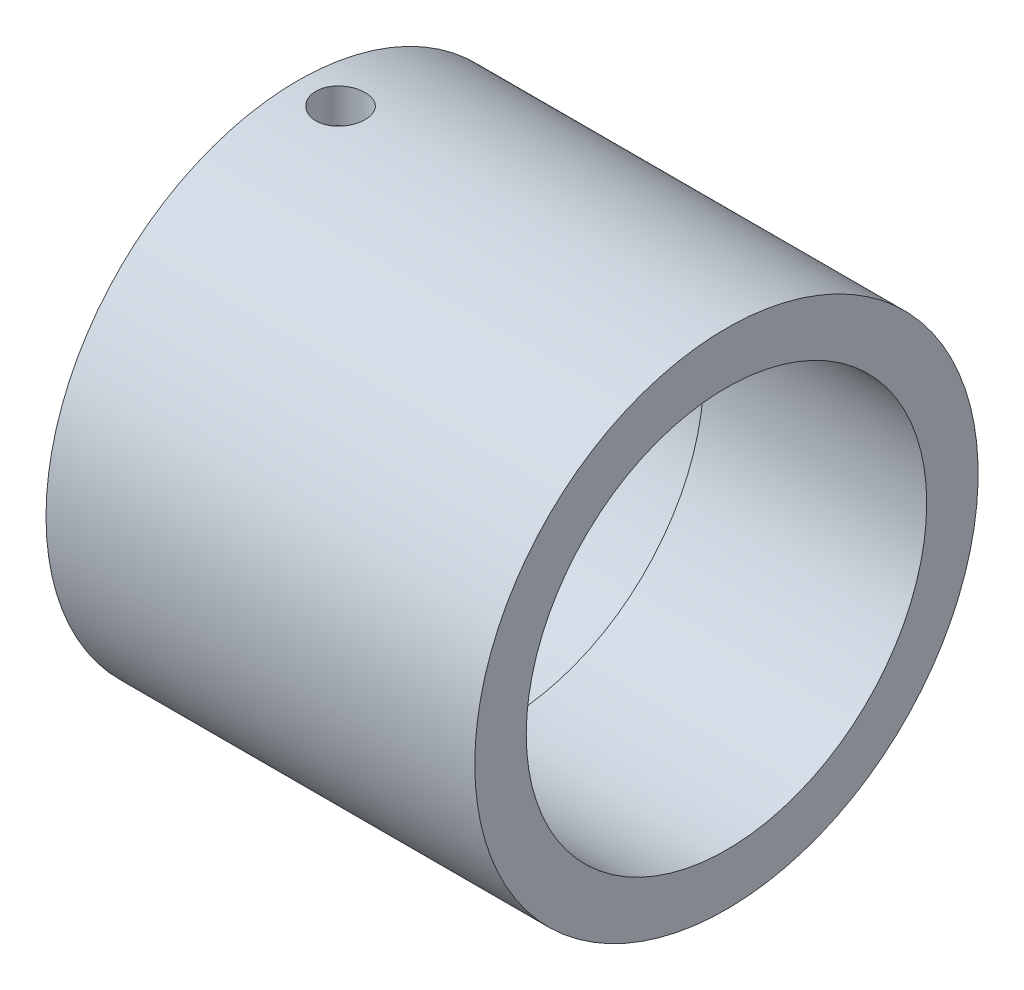
ISO-10303-21;
HEADER;
FILE_DESCRIPTION(('STEP AP214'),'2;1');
FILE_NAME('part.step','',(''),(''),'','','');
FILE_SCHEMA(('AUTOMOTIVE_DESIGN { 1 0 10303 214 1 1 1 1 }'));
ENDSEC;
DATA;
#1=APPLICATION_CONTEXT('core data for automotive mechanical design processes');
#2=APPLICATION_PROTOCOL_DEFINITION('international standard','automotive_design',2000,#1);
#3=PRODUCT_CONTEXT('',#1,'mechanical');
#4=PRODUCT('Part','Part','',(#3));
#5=PRODUCT_RELATED_PRODUCT_CATEGORY('part','',(#4));
#6=PRODUCT_DEFINITION_FORMATION('','',#4);
#7=PRODUCT_DEFINITION_CONTEXT('part definition',#1,'design');
#8=PRODUCT_DEFINITION('design','',#6,#7);
#9=PRODUCT_DEFINITION_SHAPE('','',#8);
#10=(LENGTH_UNIT() NAMED_UNIT(*) SI_UNIT(.MILLI.,.METRE.));
#11=(NAMED_UNIT(*) PLANE_ANGLE_UNIT() SI_UNIT($,.RADIAN.));
#12=(NAMED_UNIT(*) SI_UNIT($,.STERADIAN.) SOLID_ANGLE_UNIT());
#13=UNCERTAINTY_MEASURE_WITH_UNIT(LENGTH_MEASURE(1.E-05),#10,'distance_accuracy_value','');
#14=(GEOMETRIC_REPRESENTATION_CONTEXT(3) GLOBAL_UNCERTAINTY_ASSIGNED_CONTEXT((#13)) GLOBAL_UNIT_ASSIGNED_CONTEXT((#10,
#11,#12)) REPRESENTATION_CONTEXT('',''));
#15=CARTESIAN_POINT('',(0.,0.,0.));
#16=DIRECTION('',(0.,0.,1.));
#17=DIRECTION('',(1.,0.,0.));
#18=AXIS2_PLACEMENT_3D('',#15,#16,#17);
#19=CARTESIAN_POINT('',(0.,0.,-14.675));
#20=DIRECTION('',(-1.,0.,0.));
#21=DIRECTION('',(0.,0.,1.));
#22=AXIS2_PLACEMENT_3D('',#19,#20,#21);
#23=PLANE('',#22);
#24=CARTESIAN_POINT('',(0.,0.,0.));
#25=DIRECTION('',(-1.,0.,0.));
#26=DIRECTION('',(0.,0.,1.));
#27=AXIS2_PLACEMENT_3D('',#24,#25,#26);
#28=CIRCLE('',#27,14.675);
#29=CARTESIAN_POINT('',(0.,0.,14.675));
#30=VERTEX_POINT('',#29);
#31=EDGE_CURVE('E106',#30,#30,#28,.T.);
#32=ORIENTED_EDGE('',*,*,#31,.F.);
#33=EDGE_LOOP('',(#32));
#34=FACE_BOUND('',#33,.T.);
#35=CARTESIAN_POINT('',(0.,0.,0.));
#36=DIRECTION('',(-1.,0.,0.));
#37=DIRECTION('',(0.,0.,1.));
#38=AXIS2_PLACEMENT_3D('',#35,#36,#37);
#39=CIRCLE('',#38,11.675);
#40=CARTESIAN_POINT('',(0.,0.,11.675));
#41=VERTEX_POINT('',#40);
#42=EDGE_CURVE('E45',#41,#41,#39,.T.);
#43=ORIENTED_EDGE('',*,*,#42,.T.);
#44=EDGE_LOOP('',(#43));
#45=FACE_BOUND('',#44,.T.);
#46=ADVANCED_FACE('F31',(#34,#45),#23,.F.);
#47=CARTESIAN_POINT('',(-30.3673803315951,0.,0.));
#48=DIRECTION('',(-1.,0.,0.));
#49=DIRECTION('',(0.,0.,1.));
#50=AXIS2_PLACEMENT_3D('',#47,#48,#49);
#51=CYLINDRICAL_SURFACE('',#50,11.675);
#52=ORIENTED_EDGE('',*,*,#42,.F.);
#53=EDGE_LOOP('',(#52));
#54=FACE_BOUND('',#53,.T.);
#55=CARTESIAN_POINT('',(-13.,0.,0.));
#56=DIRECTION('',(-1.,0.,0.));
#57=DIRECTION('',(0.,0.,1.));
#58=AXIS2_PLACEMENT_3D('',#55,#56,#57);
#59=CIRCLE('',#58,11.675);
#60=CARTESIAN_POINT('',(-13.,0.,11.675));
#61=VERTEX_POINT('',#60);
#62=EDGE_CURVE('E49',#61,#61,#59,.T.);
#63=ORIENTED_EDGE('',*,*,#62,.T.);
#64=EDGE_LOOP('',(#63));
#65=FACE_BOUND('',#64,.T.);
#66=ADVANCED_FACE('F85',(#54,#65),#51,.F.);
#67=CARTESIAN_POINT('',(-13.,0.,-11.675));
#68=DIRECTION('',(1.,0.,0.));
#69=DIRECTION('',(0.,0.,-1.));
#70=AXIS2_PLACEMENT_3D('',#67,#68,#69);
#71=PLANE('',#70);
#72=ORIENTED_EDGE('',*,*,#62,.F.);
#73=EDGE_LOOP('',(#72));
#74=FACE_BOUND('',#73,.T.);
#75=CARTESIAN_POINT('',(-13.,0.,0.));
#76=DIRECTION('',(-1.,0.,0.));
#77=DIRECTION('',(0.,0.,1.));
#78=AXIS2_PLACEMENT_3D('',#75,#76,#77);
#79=CIRCLE('',#78,12.675);
#80=CARTESIAN_POINT('',(-13.,0.,12.675));
#81=VERTEX_POINT('',#80);
#82=EDGE_CURVE('E97',#81,#81,#79,.T.);
#83=ORIENTED_EDGE('',*,*,#82,.T.);
#84=EDGE_LOOP('',(#83));
#85=FACE_BOUND('',#84,.T.);
#86=ADVANCED_FACE('F81',(#74,#85),#71,.F.);
#87=CARTESIAN_POINT('',(-30.3673803315951,0.,0.));
#88=DIRECTION('',(-1.,0.,0.));
#89=DIRECTION('',(0.,0.,1.));
#90=AXIS2_PLACEMENT_3D('',#87,#88,#89);
#91=CYLINDRICAL_SURFACE('',#90,12.675);
#92=CARTESIAN_POINT('',(-22.5,-12.5935062631501,1.435));
#93=CARTESIAN_POINT('',(-22.5803269633296,-12.5935073193798,1.43499655106017));
#94=CARTESIAN_POINT('',(-22.6607055840986,-12.5942830953082,1.42823257152357));
#95=CARTESIAN_POINT('',(-22.8192300836796,-12.5973015764013,1.40135428461897));
#96=CARTESIAN_POINT('',(-22.8973734717594,-12.5995458561851,1.3812256465106));
#97=CARTESIAN_POINT('',(-23.0491091300628,-12.6052439528025,1.32821538258512));
#98=CARTESIAN_POINT('',(-23.1227042893579,-12.608696992335,1.29534195093697));
#99=CARTESIAN_POINT('',(-23.2633180971489,-12.6164225923108,1.21779193801993));
#100=CARTESIAN_POINT('',(-23.3303379572645,-12.62069500134,1.17311753691955));
#101=CARTESIAN_POINT('',(-23.4562230108082,-12.6296000458246,1.0730124711608));
#102=CARTESIAN_POINT('',(-23.5150534951842,-12.6342340919284,1.01753827979628));
#103=CARTESIAN_POINT('',(-23.6225904423951,-12.6433275311458,0.897501771002371));
#104=CARTESIAN_POINT('',(-23.6712964220668,-12.6477869159159,0.832939020093825));
#105=CARTESIAN_POINT('',(-23.7573242838442,-12.6560428037771,0.696342350992764));
#106=CARTESIAN_POINT('',(-23.7946150592816,-12.6598374837213,0.624288722420786));
#107=CARTESIAN_POINT('',(-23.8565548518733,-12.6663209675617,0.474891927981048));
#108=CARTESIAN_POINT('',(-23.8812042576668,-12.6690098054548,0.397548924809797));
#109=CARTESIAN_POINT('',(-23.9170587412048,-12.6729687248718,0.240122080145635));
#110=CARTESIAN_POINT('',(-23.9283212356007,-12.6742448638505,0.160051470240858));
#111=CARTESIAN_POINT('',(-23.9372599966771,-12.6752552455972,-0.000852848252713375));
#112=CARTESIAN_POINT('',(-23.9349367070755,-12.6749895387227,-0.0816865318330791));
#113=CARTESIAN_POINT('',(-23.9168161583721,-12.6729510952702,-0.241432218458438));
#114=CARTESIAN_POINT('',(-23.90108064364,-12.671185264768,-0.320351325874863));
#115=CARTESIAN_POINT('',(-23.8566786732493,-12.6663528250065,-0.474421314646284));
#116=CARTESIAN_POINT('',(-23.8280120098467,-12.6632861948495,-0.54957213544071));
#117=CARTESIAN_POINT('',(-23.7584948083044,-12.6561849200862,-0.6941651810532));
#118=CARTESIAN_POINT('',(-23.7176172499206,-12.6521481326309,-0.763594305614284));
#119=CARTESIAN_POINT('',(-23.6248582578162,-12.6435588451838,-0.894630195378186));
#120=CARTESIAN_POINT('',(-23.5729764100097,-12.6390063257883,-0.956236666078934));
#121=CARTESIAN_POINT('',(-23.4593350330123,-12.6298656274134,-1.07024067103761));
#122=CARTESIAN_POINT('',(-23.3975217409347,-12.625277391631,-1.12258462352737));
#123=CARTESIAN_POINT('',(-23.2659576654872,-12.6166077150984,-1.21616210590077));
#124=CARTESIAN_POINT('',(-23.1962068646,-12.6125262754667,-1.25739561126411));
#125=CARTESIAN_POINT('',(-23.0507032770789,-12.6053321765324,-1.32758313119968));
#126=CARTESIAN_POINT('',(-22.9749486410318,-12.6022198172105,-1.35653334445854));
#127=CARTESIAN_POINT('',(-22.8196103558718,-12.5973223216915,-1.40128753451199));
#128=CARTESIAN_POINT('',(-22.7400268573283,-12.595537133349,-1.41709202781338));
#129=CARTESIAN_POINT('',(-22.5797617418361,-12.5935054156559,-1.43503620395096));
#130=CARTESIAN_POINT('',(-22.4990886459588,-12.5932504207989,-1.4372510703644));
#131=CARTESIAN_POINT('',(-22.3385205180107,-12.5942855999477,-1.42815103342133));
#132=CARTESIAN_POINT('',(-22.2586254724227,-12.595575747061,-1.41683636554013));
#133=CARTESIAN_POINT('',(-22.1021036008946,-12.5995481322832,-1.38106154685739));
#134=CARTESIAN_POINT('',(-22.0254684467477,-12.6022265596683,-1.35663737415921));
#135=CARTESIAN_POINT('',(-21.877382042179,-12.6086706289983,-1.29537374014247));
#136=CARTESIAN_POINT('',(-21.8059309426628,-12.6124363025765,-1.25853391758589));
#137=CARTESIAN_POINT('',(-21.6698994598502,-12.6206509602795,-1.17329814067732));
#138=CARTESIAN_POINT('',(-21.6053503094742,-12.625102844965,-1.12485262434416));
#139=CARTESIAN_POINT('',(-21.4852727406331,-12.6341790201357,-1.01785119635597));
#140=CARTESIAN_POINT('',(-21.4297446091847,-12.6388033161006,-0.959294963136382));
#141=CARTESIAN_POINT('',(-21.3290236218181,-12.6477290622367,-0.83340699024054));
#142=CARTESIAN_POINT('',(-21.2838799921328,-12.6520289123139,-0.7660357359682));
#143=CARTESIAN_POINT('',(-21.2055491449992,-12.6597976922568,-0.624623799119411));
#144=CARTESIAN_POINT('',(-21.1723617243316,-12.6632666362451,-0.550583229927911));
#145=CARTESIAN_POINT('',(-21.1189677145968,-12.6689755903311,-0.39810208443873));
#146=CARTESIAN_POINT('',(-21.0987320388411,-12.6712183524912,-0.31967180063139));
#147=CARTESIAN_POINT('',(-21.0717211529702,-12.6742336091581,-0.160499898147202));
#148=CARTESIAN_POINT('',(-21.0649454502233,-12.6750061574745,-0.0797583641712842));
#149=CARTESIAN_POINT('',(-21.0650549088229,-12.6749938017734,0.0812620248818677));
#150=CARTESIAN_POINT('',(-21.0718639127472,-12.6742175803346,0.161540943155258));
#151=CARTESIAN_POINT('',(-21.0987890012936,-12.67121208525,0.319806194755735));
#152=CARTESIAN_POINT('',(-21.1189050873839,-12.6689828114439,0.397792527829874));
#153=CARTESIAN_POINT('',(-21.1718507706873,-12.6633207517606,0.549253500409719));
#154=CARTESIAN_POINT('',(-21.2046774143161,-12.6598882454993,0.622729183474558));
#155=CARTESIAN_POINT('',(-21.2821044532209,-12.6522010674011,0.76314044194555));
#156=CARTESIAN_POINT('',(-21.3267048853935,-12.6479463929877,0.83007599685546));
#157=CARTESIAN_POINT('',(-21.4266973882949,-12.6390621557962,0.955896803530534));
#158=CARTESIAN_POINT('',(-21.482146202323,-12.6344307000585,1.01473682833387));
#159=CARTESIAN_POINT('',(-21.602145719754,-12.6253305308848,1.12230845900698));
#160=CARTESIAN_POINT('',(-21.6666985887478,-12.6208618564888,1.17103765296777));
#161=CARTESIAN_POINT('',(-21.8033056058828,-12.6125780029848,1.25713304044774));
#162=CARTESIAN_POINT('',(-21.8753830259813,-12.6087649539785,1.29446249049536));
#163=CARTESIAN_POINT('',(-22.0247833433158,-12.6022491871702,1.35643660382062));
#164=CARTESIAN_POINT('',(-22.1021003215889,-12.5995452400337,1.38109531911425));
#165=CARTESIAN_POINT('',(-22.233197338107,-12.5962230901322,1.41100131416781));
#166=CARTESIAN_POINT('',(-22.2861445660978,-12.595209225077,1.41998820366492));
#167=CARTESIAN_POINT('',(-22.3927201837597,-12.5938504607883,1.43198868107949));
#168=CARTESIAN_POINT('',(-22.4463485694839,-12.5935055576804,1.43500230359207));
#169=CARTESIAN_POINT('',(-22.5,-12.5935062631501,1.435));
#170=B_SPLINE_CURVE_WITH_KNOTS('',3,(#92,#93,#94,#95,#96,#97,#98,#99,#100,#101,#102,#103,#104,
#105,#106,#107,#108,#109,#110,#111,#112,#113,#114,#115,#116,#117,#118,#119,#120,#121,#122,#123,
#124,#125,#126,#127,#128,#129,#130,#131,#132,#133,#134,#135,#136,#137,#138,#139,#140,#141,#142,
#143,#144,#145,#146,#147,#148,#149,#150,#151,#152,#153,#154,#155,#156,#157,#158,#159,#160,#161,
#162,#163,#164,#165,#166,#167,#168,#169),.UNSPECIFIED.,.T.,.F.,(4,2,2,2,2,2,2,2,2,2,2,2,2,2,2,2,
2,2,2,2,2,2,2,2,2,2,2,2,2,2,2,2,2,2,2,2,2,2,4),(0.,0.240784929522118,0.481828467301215,
0.722717284280372,0.96356162937428,1.20539753959266,1.44724498809349,1.68974572657963,
1.93223900930838,2.17368843822364,2.41512998133261,2.65546599312933,2.89580586615673,
3.13668155276468,3.37756630501335,3.61980195233018,3.86203813424649,4.10434922647075,
4.34665079763108,4.58761063611237,4.82856628085975,5.06886399614124,5.30916870357902,
5.55051852067947,5.79187601516286,6.03435507788281,6.27683001899669,6.51875848766894,
6.76067810165375,7.00124529738597,7.24181251966056,7.4823238742352,7.72283598252925,
7.96464146792292,8.20650456915651,8.44913920595521,8.69150417373401,8.85232851216289,
9.01315191914983),.UNSPECIFIED.);
#171=CARTESIAN_POINT('',(-22.5,-12.5935062631501,1.435));
#172=VERTEX_POINT('',#171);
#173=EDGE_CURVE('E72',#172,#172,#170,.T.);
#174=ORIENTED_EDGE('',*,*,#173,.T.);
#175=EDGE_LOOP('',(#174));
#176=FACE_BOUND('',#175,.T.);
#177=CARTESIAN_POINT('',(-22.5,12.5935062631501,1.435));
#178=CARTESIAN_POINT('',(-22.4196730366704,12.5935073193798,1.43499655106017));
#179=CARTESIAN_POINT('',(-22.3392944159014,12.5942830953082,1.42823257152357));
#180=CARTESIAN_POINT('',(-22.1807699163204,12.5973015764013,1.40135428461897));
#181=CARTESIAN_POINT('',(-22.1026265282406,12.5995458561851,1.3812256465106));
#182=CARTESIAN_POINT('',(-21.9508908699372,12.6052439528025,1.32821538258512));
#183=CARTESIAN_POINT('',(-21.8772957106421,12.608696992335,1.29534195093697));
#184=CARTESIAN_POINT('',(-21.7366819028511,12.6164225923108,1.21779193801993));
#185=CARTESIAN_POINT('',(-21.6696620427355,12.62069500134,1.17311753691955));
#186=CARTESIAN_POINT('',(-21.5437769891918,12.6296000458246,1.0730124711608));
#187=CARTESIAN_POINT('',(-21.4849465048158,12.6342340919284,1.01753827979628));
#188=CARTESIAN_POINT('',(-21.3774095576049,12.6433275311458,0.897501771002371));
#189=CARTESIAN_POINT('',(-21.3287035779332,12.6477869159159,0.832939020093825));
#190=CARTESIAN_POINT('',(-21.2426757161558,12.6560428037771,0.696342350992764));
#191=CARTESIAN_POINT('',(-21.2053849407183,12.6598374837213,0.624288722420786));
#192=CARTESIAN_POINT('',(-21.1434451481267,12.6663209675617,0.474891927981049));
#193=CARTESIAN_POINT('',(-21.1187957423332,12.6690098054548,0.397548924809799));
#194=CARTESIAN_POINT('',(-21.0829412587952,12.6729687248718,0.240122080145638));
#195=CARTESIAN_POINT('',(-21.0716787643993,12.6742448638505,0.16005147024086));
#196=CARTESIAN_POINT('',(-21.0627400033229,12.6752552455972,-0.000852848252711735));
#197=CARTESIAN_POINT('',(-21.0650632929245,12.6749895387227,-0.081686531833078));
#198=CARTESIAN_POINT('',(-21.0831838416279,12.6729510952702,-0.241432218458437));
#199=CARTESIAN_POINT('',(-21.09891935636,12.671185264768,-0.320351325874862));
#200=CARTESIAN_POINT('',(-21.1433213267507,12.6663528250065,-0.474421314646283));
#201=CARTESIAN_POINT('',(-21.1719879901533,12.6632861948495,-0.54957213544071));
#202=CARTESIAN_POINT('',(-21.2415051916956,12.6561849200862,-0.6941651810532));
#203=CARTESIAN_POINT('',(-21.2823827500794,12.6521481326309,-0.763594305614284));
#204=CARTESIAN_POINT('',(-21.3751417421838,12.6435588451838,-0.894630195378186));
#205=CARTESIAN_POINT('',(-21.4270235899903,12.6390063257883,-0.956236666078934));
#206=CARTESIAN_POINT('',(-21.5406649669877,12.6298656274134,-1.07024067103761));
#207=CARTESIAN_POINT('',(-21.6024782590653,12.625277391631,-1.12258462352737));
#208=CARTESIAN_POINT('',(-21.7340423345128,12.6166077150984,-1.21616210590077));
#209=CARTESIAN_POINT('',(-21.8037931354,12.6125262754667,-1.25739561126411));
#210=CARTESIAN_POINT('',(-21.9492967229211,12.6053321765324,-1.32758313119968));
#211=CARTESIAN_POINT('',(-22.0250513589682,12.6022198172105,-1.35653334445854));
#212=CARTESIAN_POINT('',(-22.1803896441282,12.5973223216915,-1.40128753451199));
#213=CARTESIAN_POINT('',(-22.2599731426717,12.595537133349,-1.41709202781338));
#214=CARTESIAN_POINT('',(-22.4202382581639,12.5935054156559,-1.43503620395096));
#215=CARTESIAN_POINT('',(-22.5009113540412,12.5932504207989,-1.4372510703644));
#216=CARTESIAN_POINT('',(-22.6614794819893,12.5942855999477,-1.42815103342133));
#217=CARTESIAN_POINT('',(-22.7413745275773,12.595575747061,-1.41683636554013));
#218=CARTESIAN_POINT('',(-22.8978963991054,12.5995481322832,-1.38106154685739));
#219=CARTESIAN_POINT('',(-22.9745315532523,12.6022265596683,-1.35663737415921));
#220=CARTESIAN_POINT('',(-23.122617957821,12.6086706289983,-1.29537374014247));
#221=CARTESIAN_POINT('',(-23.1940690573372,12.6124363025765,-1.25853391758589));
#222=CARTESIAN_POINT('',(-23.3301005401498,12.6206509602795,-1.17329814067732));
#223=CARTESIAN_POINT('',(-23.3946496905258,12.625102844965,-1.12485262434416));
#224=CARTESIAN_POINT('',(-23.5147272593669,12.6341790201357,-1.01785119635597));
#225=CARTESIAN_POINT('',(-23.5702553908153,12.6388033161006,-0.959294963136382));
#226=CARTESIAN_POINT('',(-23.6709763781819,12.6477290622367,-0.83340699024054));
#227=CARTESIAN_POINT('',(-23.7161200078672,12.6520289123139,-0.7660357359682));
#228=CARTESIAN_POINT('',(-23.7944508550008,12.6597976922568,-0.624623799119411));
#229=CARTESIAN_POINT('',(-23.8276382756684,12.6632666362451,-0.550583229927911));
#230=CARTESIAN_POINT('',(-23.8810322854032,12.6689755903311,-0.39810208443873));
#231=CARTESIAN_POINT('',(-23.9012679611589,12.6712183524912,-0.31967180063139));
#232=CARTESIAN_POINT('',(-23.9282788470298,12.6742336091581,-0.160499898147203));
#233=CARTESIAN_POINT('',(-23.9350545497767,12.6750061574745,-0.0797583641712844));
#234=CARTESIAN_POINT('',(-23.9349450911771,12.6749938017734,0.0812620248818675));
#235=CARTESIAN_POINT('',(-23.9281360872528,12.6742175803346,0.161540943155258));
#236=CARTESIAN_POINT('',(-23.9012109987064,12.67121208525,0.319806194755734));
#237=CARTESIAN_POINT('',(-23.8810949126161,12.6689828114439,0.397792527829874));
#238=CARTESIAN_POINT('',(-23.8281492293127,12.6633207517606,0.54925350040972));
#239=CARTESIAN_POINT('',(-23.7953225856839,12.6598882454993,0.622729183474559));
#240=CARTESIAN_POINT('',(-23.7178955467791,12.6522010674011,0.763140441945551));
#241=CARTESIAN_POINT('',(-23.6732951146065,12.6479463929877,0.83007599685546));
#242=CARTESIAN_POINT('',(-23.5733026117051,12.6390621557962,0.955896803530534));
#243=CARTESIAN_POINT('',(-23.517853797677,12.6344307000585,1.01473682833387));
#244=CARTESIAN_POINT('',(-23.397854280246,12.6253305308848,1.12230845900698));
#245=CARTESIAN_POINT('',(-23.3333014112521,12.6208618564888,1.17103765296777));
#246=CARTESIAN_POINT('',(-23.1966943941172,12.6125780029848,1.25713304044774));
#247=CARTESIAN_POINT('',(-23.1246169740187,12.6087649539785,1.29446249049536));
#248=CARTESIAN_POINT('',(-22.9752166566842,12.6022491871702,1.35643660382061));
#249=CARTESIAN_POINT('',(-22.8978996784111,12.5995452400337,1.38109531911425));
#250=CARTESIAN_POINT('',(-22.766802661893,12.5962230901322,1.41100131416781));
#251=CARTESIAN_POINT('',(-22.7138554339022,12.595209225077,1.41998820366492));
#252=CARTESIAN_POINT('',(-22.6072798162403,12.5938504607883,1.43198868107949));
#253=CARTESIAN_POINT('',(-22.5536514305161,12.5935055576804,1.43500230359207));
#254=CARTESIAN_POINT('',(-22.5,12.5935062631501,1.435));
#255=B_SPLINE_CURVE_WITH_KNOTS('',3,(#177,#178,#179,#180,#181,#182,#183,#184,#185,#186,#187,
#188,#189,#190,#191,#192,#193,#194,#195,#196,#197,#198,#199,#200,#201,#202,#203,#204,#205,#206,
#207,#208,#209,#210,#211,#212,#213,#214,#215,#216,#217,#218,#219,#220,#221,#222,#223,#224,#225,
#226,#227,#228,#229,#230,#231,#232,#233,#234,#235,#236,#237,#238,#239,#240,#241,#242,#243,#244,
#245,#246,#247,#248,#249,#250,#251,#252,#253,#254),.UNSPECIFIED.,.T.,.F.,(4,2,2,2,2,2,2,2,2,2,2,
2,2,2,2,2,2,2,2,2,2,2,2,2,2,2,2,2,2,2,2,2,2,2,2,2,2,2,4),(0.,0.240784929522118,
0.481828467301215,0.722717284280372,0.96356162937428,1.20539753959266,1.44724498809349,
1.68974572657963,1.93223900930838,2.17368843822363,2.41512998133261,2.65546599312933,
2.89580586615673,3.13668155276468,3.37756630501335,3.61980195233018,3.86203813424649,
4.10434922647075,4.34665079763108,4.58761063611237,4.82856628085975,5.06886399614124,
5.30916870357902,5.55051852067947,5.79187601516286,6.03435507788281,6.27683001899669,
6.51875848766894,6.76067810165375,7.00124529738597,7.24181251966055,7.4823238742352,
7.72283598252925,7.96464146792292,8.20650456915651,8.4491392059552,8.69150417373401,
8.8523285121629,9.01315191914983),.UNSPECIFIED.);
#256=CARTESIAN_POINT('',(-22.5,12.5935062631501,1.435));
#257=VERTEX_POINT('',#256);
#258=EDGE_CURVE('E67',#257,#257,#255,.T.);
#259=ORIENTED_EDGE('',*,*,#258,.T.);
#260=EDGE_LOOP('',(#259));
#261=FACE_BOUND('',#260,.T.);
#262=ORIENTED_EDGE('',*,*,#82,.F.);
#263=EDGE_LOOP('',(#262));
#264=FACE_BOUND('',#263,.T.);
#265=CARTESIAN_POINT('',(-25.,0.,0.));
#266=DIRECTION('',(-1.,0.,0.));
#267=DIRECTION('',(0.,0.,1.));
#268=AXIS2_PLACEMENT_3D('',#265,#266,#267);
#269=CIRCLE('',#268,12.675);
#270=CARTESIAN_POINT('',(-25.,0.,12.675));
#271=VERTEX_POINT('',#270);
#272=EDGE_CURVE('E99',#271,#271,#269,.T.);
#273=ORIENTED_EDGE('',*,*,#272,.T.);
#274=EDGE_LOOP('',(#273));
#275=FACE_BOUND('',#274,.T.);
#276=ADVANCED_FACE('F76',(#176,#261,#264,#275),#91,.F.);
#277=CARTESIAN_POINT('',(-25.,0.,-12.675));
#278=DIRECTION('',(1.,0.,0.));
#279=DIRECTION('',(0.,0.,-1.));
#280=AXIS2_PLACEMENT_3D('',#277,#278,#279);
#281=PLANE('',#280);
#282=ORIENTED_EDGE('',*,*,#272,.F.);
#283=EDGE_LOOP('',(#282));
#284=FACE_BOUND('',#283,.T.);
#285=CARTESIAN_POINT('',(-25.,0.,0.));
#286=DIRECTION('',(-1.,0.,0.));
#287=DIRECTION('',(0.,0.,1.));
#288=AXIS2_PLACEMENT_3D('',#285,#286,#287);
#289=CIRCLE('',#288,14.675);
#290=CARTESIAN_POINT('',(-25.,0.,14.675));
#291=VERTEX_POINT('',#290);
#292=EDGE_CURVE('E104',#291,#291,#289,.T.);
#293=ORIENTED_EDGE('',*,*,#292,.T.);
#294=EDGE_LOOP('',(#293));
#295=FACE_BOUND('',#294,.T.);
#296=ADVANCED_FACE('F80',(#284,#295),#281,.F.);
#297=CARTESIAN_POINT('',(-30.3673803315951,0.,0.));
#298=DIRECTION('',(-1.,0.,0.));
#299=DIRECTION('',(0.,0.,1.));
#300=AXIS2_PLACEMENT_3D('',#297,#298,#299);
#301=CYLINDRICAL_SURFACE('',#300,14.675);
#302=CARTESIAN_POINT('',(-23.935,-14.675,0.));
#303=CARTESIAN_POINT('',(-23.9349965138731,-14.6749990930978,0.0803986067015495));
#304=CARTESIAN_POINT('',(-23.9282205269713,-14.6743322671584,0.160850594891414));
#305=CARTESIAN_POINT('',(-23.9012917152157,-14.6717362863236,0.319524773028279));
#306=CARTESIAN_POINT('',(-23.8811240930121,-14.6698057350838,0.397744396450449));
#307=CARTESIAN_POINT('',(-23.8280041712783,-14.6649002622123,0.549633064201489));
#308=CARTESIAN_POINT('',(-23.7950595234358,-14.6619259657424,0.623304801540112));
#309=CARTESIAN_POINT('',(-23.7173354173841,-14.6552657199593,0.764056600939189));
#310=CARTESIAN_POINT('',(-23.6725583380044,-14.6515799137305,0.831137984230896));
#311=CARTESIAN_POINT('',(-23.5722745806479,-14.6438954170081,0.95705250495568));
#312=CARTESIAN_POINT('',(-23.5167354391579,-14.6398958022068,1.01585973304411));
#313=CARTESIAN_POINT('',(-23.3965732745402,-14.6320421288818,1.12333398565359));
#314=CARTESIAN_POINT('',(-23.3319498345845,-14.6281880770475,1.17200054462105));
#315=CARTESIAN_POINT('',(-23.1952920252411,-14.6210523867558,1.25790322445445));
#316=CARTESIAN_POINT('',(-23.1232429072289,-14.6177719237733,1.29511598856606));
#317=CARTESIAN_POINT('',(-22.9738812917798,-14.6121661794091,1.35690559731282));
#318=CARTESIAN_POINT('',(-22.8965689190892,-14.6098408753982,1.38148274131156));
#319=CARTESIAN_POINT('',(-22.7391390553158,-14.6064170051452,1.41722686116419));
#320=CARTESIAN_POINT('',(-22.6590313855126,-14.6053145176162,1.42843671154561));
#321=CARTESIAN_POINT('',(-22.4980646113234,-14.6044489043071,1.43726055924089));
#322=CARTESIAN_POINT('',(-22.4172055259282,-14.6046857447691,1.43487489923224));
#323=CARTESIAN_POINT('',(-22.2573265129906,-14.6064684490329,1.41661079811456));
#324=CARTESIAN_POINT('',(-22.1783011834983,-14.6080097741428,1.40077913898428));
#325=CARTESIAN_POINT('',(-22.0240346706864,-14.6122206852339,1.35614521806422));
#326=CARTESIAN_POINT('',(-21.9487935364825,-14.6148902858549,1.32734278797338));
#327=CARTESIAN_POINT('',(-21.8040832660718,-14.621062173963,1.25753317611763));
#328=CARTESIAN_POINT('',(-21.7346242215295,-14.6245658777483,1.21650520536589));
#329=CARTESIAN_POINT('',(-21.6035602386367,-14.6320099795466,1.12342409091386));
#330=CARTESIAN_POINT('',(-21.5419555201117,-14.6359503897764,1.07137063874262));
#331=CARTESIAN_POINT('',(-21.428077049365,-14.6438441390187,0.957454721842501));
#332=CARTESIAN_POINT('',(-21.3758437088153,-14.6477974625462,0.895551849127771));
#333=CARTESIAN_POINT('',(-21.2825038187692,-14.6552558989122,0.763834693673762));
#334=CARTESIAN_POINT('',(-21.241397280934,-14.658761011281,0.694020402643193));
#335=CARTESIAN_POINT('',(-21.1714796091105,-14.6649291723244,0.548434431154103));
#336=CARTESIAN_POINT('',(-21.1426704881929,-14.6675920831133,0.472661777721975));
#337=CARTESIAN_POINT('',(-21.0981948631842,-14.6717743723897,0.317323026431444));
#338=CARTESIAN_POINT('',(-21.0825279833293,-14.6732937835722,0.237757037101078));
#339=CARTESIAN_POINT('',(-21.0648327469615,-14.6750136772217,0.0774402124072936));
#340=CARTESIAN_POINT('',(-21.0627486175898,-14.6752195531926,-0.00330441149238192));
#341=CARTESIAN_POINT('',(-21.072131611464,-14.6743036337671,-0.163993819631055));
#342=CARTESIAN_POINT('',(-21.0835985597862,-14.6731818555085,-0.243938614181186));
#343=CARTESIAN_POINT('',(-21.1197119409151,-14.6697401554328,-0.400598327015016));
#344=CARTESIAN_POINT('',(-21.1443322972254,-14.6674226045327,-0.477319312973429));
#345=CARTESIAN_POINT('',(-21.2060268380387,-14.6618494067817,-0.625542096241984));
#346=CARTESIAN_POINT('',(-21.2431012901444,-14.6585937397735,-0.697043781364123));
#347=CARTESIAN_POINT('',(-21.3287901951355,-14.6514951543897,-0.833050695225431));
#348=CARTESIAN_POINT('',(-21.377441335173,-14.6476503831927,-0.897532711579958));
#349=CARTESIAN_POINT('',(-21.4848499291994,-14.6398110746119,-1.01743500659059));
#350=CARTESIAN_POINT('',(-21.543607625565,-14.6358165336381,-1.07285506785944));
#351=CARTESIAN_POINT('',(-21.6698045810554,-14.6281117049006,-1.17325359629667));
#352=CARTESIAN_POINT('',(-21.7372730088108,-14.6244024422139,-1.21819548938634));
#353=CARTESIAN_POINT('',(-21.8788321878677,-14.6177035837532,-1.29611061237351));
#354=CARTESIAN_POINT('',(-21.9529228520353,-14.614713978512,-1.32908399972101));
#355=CARTESIAN_POINT('',(-22.105497329325,-14.6097992342118,-1.38206473547436));
#356=CARTESIAN_POINT('',(-22.1839734945374,-14.6078723020467,-1.40209393518989));
#357=CARTESIAN_POINT('',(-22.3431948082689,-14.6052954451491,-1.4286886749995));
#358=CARTESIAN_POINT('',(-22.4239398947551,-14.6046454855382,-1.4352545828207));
#359=CARTESIAN_POINT('',(-22.5850434818127,-14.6046968656811,-1.43473137754481));
#360=CARTESIAN_POINT('',(-22.6654021769756,-14.6053925197332,-1.42769971909088));
#361=CARTESIAN_POINT('',(-22.8237909574145,-14.6080446271108,-1.4003013553902));
#362=CARTESIAN_POINT('',(-22.9018210399217,-14.6100010819353,-1.37993463428777));
#363=CARTESIAN_POINT('',(-23.0533377600785,-14.614952781749,-1.32645995387067));
#364=CARTESIAN_POINT('',(-23.1268249654065,-14.6179478966366,-1.29335359025375));
#365=CARTESIAN_POINT('',(-23.2672085666807,-14.6246397025952,-1.21534537762074));
#366=CARTESIAN_POINT('',(-23.3341050089988,-14.6283363887294,-1.17044361160426));
#367=CARTESIAN_POINT('',(-23.4597025709816,-14.6360335089848,-1.06990334223902));
#368=CARTESIAN_POINT('',(-23.5183693680739,-14.6400351137236,-1.01422205094837));
#369=CARTESIAN_POINT('',(-23.6255523955968,-14.647880491952,-0.893787244415827));
#370=CARTESIAN_POINT('',(-23.6740661878619,-14.6517242273528,-0.829031556246824));
#371=CARTESIAN_POINT('',(-23.7596575519758,-14.6588303767957,-0.692115645129872));
#372=CARTESIAN_POINT('',(-23.7967071377876,-14.6620913601795,-0.619937866483754));
#373=CARTESIAN_POINT('',(-23.8581116346449,-14.667648883198,-0.470400296524548));
#374=CARTESIAN_POINT('',(-23.8824808990636,-14.6699465127174,-0.393046476659343));
#375=CARTESIAN_POINT('',(-23.9117378366511,-14.6727393292939,-0.262710056092332));
#376=CARTESIAN_POINT('',(-23.9204492756419,-14.6735831411136,-0.210561376924699));
#377=CARTESIAN_POINT('',(-23.9320814911638,-14.6747137732847,-0.10561614350773));
#378=CARTESIAN_POINT('',(-23.9350022902859,-14.6750005958089,-0.052819591786735));
#379=CARTESIAN_POINT('',(-23.935,-14.675,0.));
#380=B_SPLINE_CURVE_WITH_KNOTS('',3,(#302,#303,#304,#305,#306,#307,#308,#309,#310,#311,#312,
#313,#314,#315,#316,#317,#318,#319,#320,#321,#322,#323,#324,#325,#326,#327,#328,#329,#330,#331,
#332,#333,#334,#335,#336,#337,#338,#339,#340,#341,#342,#343,#344,#345,#346,#347,#348,#349,#350,
#351,#352,#353,#354,#355,#356,#357,#358,#359,#360,#361,#362,#363,#364,#365,#366,#367,#368,#369,
#370,#371,#372,#373,#374,#375,#376,#377,#378,#379),.UNSPECIFIED.,.T.,.F.,(4,2,2,2,2,2,2,2,2,2,2,
2,2,2,2,2,2,2,2,2,2,2,2,2,2,2,2,2,2,2,2,2,2,2,2,2,2,2,4),(0.,0.241002946756875,
0.482272638572812,0.723398065452548,0.964475052543898,1.2062908930915,1.44811783285123,
1.69043469165994,1.93274580922412,2.17427762461804,2.41580335218234,2.65649217791346,
2.89718412677047,3.13828772014807,3.37939806001369,3.62152436581351,3.8636509253679,
4.10581710552896,4.34797636142397,4.58914064437361,4.83030181429705,5.07098664922072,
5.31167665610236,5.55313982668685,5.79460878888235,6.03690838592775,6.27920479531936,
6.52109110403498,6.76297080594607,7.00383071134483,7.24469090313174,7.48552093590693,
7.72634927410145,7.96815391100405,8.2100165489574,8.45246503884003,8.69463849108408,
8.85297117185644,9.01130323492754),.UNSPECIFIED.);
#381=CARTESIAN_POINT('',(-23.935,-14.675,0.));
#382=VERTEX_POINT('',#381);
#383=EDGE_CURVE('E10',#382,#382,#380,.T.);
#384=ORIENTED_EDGE('',*,*,#383,.T.);
#385=EDGE_LOOP('',(#384));
#386=FACE_BOUND('',#385,.T.);
#387=CARTESIAN_POINT('',(-22.5,14.6046704858412,1.435));
#388=CARTESIAN_POINT('',(-22.5803975705612,14.6046714090223,1.43499651294552));
#389=CARTESIAN_POINT('',(-22.6608485258814,14.6053415129742,1.42822069479269));
#390=CARTESIAN_POINT('',(-22.8195205579988,14.6079492034345,1.40129261425176));
#391=CARTESIAN_POINT('',(-22.8977390674597,14.6098881923681,1.3811255509324));
#392=CARTESIAN_POINT('',(-23.0496253797297,14.6148119668361,1.32800726411255));
#393=CARTESIAN_POINT('',(-23.123295884981,14.617796124153,1.2950637188767));
#394=CARTESIAN_POINT('',(-23.2640456199816,14.624473221016,1.217342209383));
#395=CARTESIAN_POINT('',(-23.331126169426,14.6281660182115,1.17256662124737));
#396=CARTESIAN_POINT('',(-23.4570416318824,14.6358587221478,1.07228437020856));
#397=CARTESIAN_POINT('',(-23.5158503713965,14.63985954437,1.01674491063649));
#398=CARTESIAN_POINT('',(-23.6233275410348,14.6477091861653,0.896581475266948));
#399=CARTESIAN_POINT('',(-23.6719955102413,14.6515579988229,0.831957086765442));
#400=CARTESIAN_POINT('',(-23.7578996646455,14.658678959041,0.695298446489331));
#401=CARTESIAN_POINT('',(-23.7951127521268,14.6619499358657,0.623249609205007));
#402=CARTESIAN_POINT('',(-23.8569030361603,14.6675367241989,0.473888603917441));
#403=CARTESIAN_POINT('',(-23.8814805282446,14.6698525580468,0.396576559062545));
#404=CARTESIAN_POINT('',(-23.9172253756322,14.6732617066913,0.239147698291306));
#405=CARTESIAN_POINT('',(-23.9284356358441,14.6743589320829,0.15904071013082));
#406=CARTESIAN_POINT('',(-23.9372605393697,14.675220529448,-0.00192472946816668));
#407=CARTESIAN_POINT('',(-23.9348755209275,14.6749849345814,-0.0827831621611162));
#408=CARTESIAN_POINT('',(-23.9166124352091,14.6732106411098,-0.242665005437443));
#409=CARTESIAN_POINT('',(-23.9007805040967,14.671676398209,-0.321693742441127));
#410=CARTESIAN_POINT('',(-23.8561448579447,14.6674823738609,-0.475966929861937));
#411=CARTESIAN_POINT('',(-23.82734098075,14.6648225783437,-0.551211332960182));
#412=CARTESIAN_POINT('',(-23.7575283732914,14.6586688507786,-0.69592556460256));
#413=CARTESIAN_POINT('',(-23.7164991917974,14.6551735229548,-0.765385465367074));
#414=CARTESIAN_POINT('',(-23.6234154936434,14.6477410204539,-0.896450647154377));
#415=CARTESIAN_POINT('',(-23.5713606678921,14.6438038333912,-0.958055707898122));
#416=CARTESIAN_POINT('',(-23.4574437771756,14.6359100908414,-1.07193262578679));
#417=CARTESIAN_POINT('',(-23.395541584544,14.6319535232485,-1.12416434863977));
#418=CARTESIAN_POINT('',(-23.263826365982,14.6244834095225,-1.21750129887854));
#419=CARTESIAN_POINT('',(-23.1940133293842,14.6209698639869,-1.25860651126053));
#420=CARTESIAN_POINT('',(-23.0484276966517,14.6147832425359,-1.32852322977978));
#421=CARTESIAN_POINT('',(-22.9726539296121,14.61211033227,-1.35733231333123));
#422=CARTESIAN_POINT('',(-22.8173127579112,14.6079110123107,-1.40180752231116));
#423=CARTESIAN_POINT('',(-22.7377454637315,14.6063845692496,-1.41747403025381));
#424=CARTESIAN_POINT('',(-22.5774280337504,14.6046567372777,-1.4351678640359));
#425=CARTESIAN_POINT('',(-22.4966841483565,14.6044498961531,-1.4372513119363));
#426=CARTESIAN_POINT('',(-22.3359963809806,14.6053702987277,-1.42786721872531));
#427=CARTESIAN_POINT('',(-22.2560524886842,14.6064975252041,-1.41639985255467));
#428=CARTESIAN_POINT('',(-22.0993972552618,14.6099540906982,-1.38028657824834));
#429=CARTESIAN_POINT('',(-22.0226797502598,14.6122810132964,-1.35566715729774));
#430=CARTESIAN_POINT('',(-21.8744635150416,14.6178728177267,-1.29397565311008));
#431=CARTESIAN_POINT('',(-21.8029648993278,14.6211377201304,-1.25690329675531));
#432=CARTESIAN_POINT('',(-21.666960074975,14.6282508117672,-1.17121747540755));
#433=CARTESIAN_POINT('',(-21.6024774145688,14.6321008672995,-1.12256679080274));
#434=CARTESIAN_POINT('',(-21.4825736079227,14.639944322449,-1.01515873263397));
#435=CARTESIAN_POINT('',(-21.427152676247,14.6439377254578,-0.956401119825108));
#436=CARTESIAN_POINT('',(-21.3267522695609,14.6516343446027,-0.830203783959672));
#437=CARTESIAN_POINT('',(-21.2818093849996,14.6553365147698,-0.762734877513615));
#438=CARTESIAN_POINT('',(-21.2038925223622,14.6620183267058,-0.621174476946695));
#439=CARTESIAN_POINT('',(-21.1709183865486,14.6649979779967,-0.54708307012047));
#440=CARTESIAN_POINT('',(-21.1179371552538,14.6698942885067,-0.394509063744722));
#441=CARTESIAN_POINT('',(-21.0979078841637,14.6718127647878,-0.316034225341153));
#442=CARTESIAN_POINT('',(-21.071312552009,14.6743780091345,-0.156815709668464));
#443=CARTESIAN_POINT('',(-21.0647461303072,14.6750248112651,-0.0760720932331523));
#444=CARTESIAN_POINT('',(-21.0652678375662,14.6749738228292,0.0850323779331626));
#445=CARTESIAN_POINT('',(-21.072299131962,14.6742816288801,0.165393424539622));
#446=CARTESIAN_POINT('',(-21.0996975947888,14.6716414698024,0.323786998711736));
#447=CARTESIAN_POINT('',(-21.1200647749202,14.669693503572,0.401819524234345));
#448=CARTESIAN_POINT('',(-21.1735412939967,14.6647600981061,0.553341137553345));
#449=CARTESIAN_POINT('',(-21.2066490590125,14.6617747870251,0.626830785260668));
#450=CARTESIAN_POINT('',(-21.2846608304912,14.6550996383539,0.767218686420982));
#451=CARTESIAN_POINT('',(-21.3295647512471,14.6514098058826,0.834116987759707));
#452=CARTESIAN_POINT('',(-21.4301073897921,14.6437206586063,0.959714439537188));
#453=CARTESIAN_POINT('',(-21.4857884027627,14.6397201629003,1.01837966031563));
#454=CARTESIAN_POINT('',(-21.6062220041696,14.6318705743972,1.1255596374921));
#455=CARTESIAN_POINT('',(-21.6709767690685,14.6280215182093,1.17407195159538));
#456=CARTESIAN_POINT('',(-21.8078919286433,14.6209005205368,1.25966172573063));
#457=CARTESIAN_POINT('',(-21.8800700451322,14.6176300132884,1.29671093399021));
#458=CARTESIAN_POINT('',(-22.0296083318439,14.6120535506991,1.35811463138316));
#459=CARTESIAN_POINT('',(-22.1069625284099,14.609746504976,1.38248347904025));
#460=CARTESIAN_POINT('',(-22.2372978338639,14.6069416377535,1.41173924177124));
#461=CARTESIAN_POINT('',(-22.2894449381656,14.6060939672511,1.42045015198009));
#462=CARTESIAN_POINT('',(-22.3943870164614,14.6049580891581,1.43208166503533));
#463=CARTESIAN_POINT('',(-22.4471819878842,14.6046698793478,1.43500229085635));
#464=CARTESIAN_POINT('',(-22.5,14.6046704858412,1.435));
#465=B_SPLINE_CURVE_WITH_KNOTS('',3,(#387,#388,#389,#390,#391,#392,#393,#394,#395,#396,#397,
#398,#399,#400,#401,#402,#403,#404,#405,#406,#407,#408,#409,#410,#411,#412,#413,#414,#415,#416,
#417,#418,#419,#420,#421,#422,#423,#424,#425,#426,#427,#428,#429,#430,#431,#432,#433,#434,#435,
#436,#437,#438,#439,#440,#441,#442,#443,#444,#445,#446,#447,#448,#449,#450,#451,#452,#453,#454,
#455,#456,#457,#458,#459,#460,#461,#462,#463,#464),.UNSPECIFIED.,.T.,.F.,(4,2,2,2,2,2,2,2,2,2,2,
2,2,2,2,2,2,2,2,2,2,2,2,2,2,2,2,2,2,2,2,2,2,2,2,2,2,2,4),(0.,0.240999834459081,
0.482266482987135,0.723388361949722,0.964461855335781,1.2062817686436,1.44811267073576,
1.69042805573545,1.93273777299565,2.17426763516677,2.41579148821663,2.65649000833654,
2.89719153737551,3.13829800902535,3.37941124071446,3.62153343016962,3.86365594611851,
4.10582614309933,4.34798929148098,4.58915124021556,4.83031007558791,5.07098505725854,
5.31166531775628,5.5531299741219,5.79460034707515,6.0369017352898,6.27919993007418,
6.52108194030556,6.76295747101876,7.00382421587246,7.24469117205658,7.48552838188801,
7.72636384192258,7.96816437211081,8.21002300104111,8.4524730478035,8.69464795711307,
8.85297590899469,9.01130323266286),.UNSPECIFIED.);
#466=CARTESIAN_POINT('',(-22.5,14.6046704858412,1.435));
#467=VERTEX_POINT('',#466);
#468=EDGE_CURVE('E41',#467,#467,#465,.T.);
#469=ORIENTED_EDGE('',*,*,#468,.T.);
#470=EDGE_LOOP('',(#469));
#471=FACE_BOUND('',#470,.T.);
#472=ORIENTED_EDGE('',*,*,#292,.F.);
#473=EDGE_LOOP('',(#472));
#474=FACE_BOUND('',#473,.T.);
#475=ORIENTED_EDGE('',*,*,#31,.T.);
#476=EDGE_LOOP('',(#475));
#477=FACE_BOUND('',#476,.T.);
#478=ADVANCED_FACE('F54',(#386,#471,#474,#477),#301,.T.);
#479=CARTESIAN_POINT('',(-22.5,-14.675,0.));
#480=DIRECTION('',(0.,1.,0.));
#481=DIRECTION('',(0.,0.,1.));
#482=AXIS2_PLACEMENT_3D('',#479,#480,#481);
#483=CYLINDRICAL_SURFACE('',#482,1.435);
#484=ORIENTED_EDGE('',*,*,#468,.F.);
#485=EDGE_LOOP('',(#484));
#486=FACE_BOUND('',#485,.T.);
#487=ORIENTED_EDGE('',*,*,#258,.F.);
#488=EDGE_LOOP('',(#487));
#489=FACE_BOUND('',#488,.T.);
#490=ADVANCED_FACE('F60',(#486,#489),#483,.F.);
#491=ORIENTED_EDGE('',*,*,#383,.F.);
#492=EDGE_LOOP('',(#491));
#493=FACE_BOUND('',#492,.T.);
#494=ORIENTED_EDGE('',*,*,#173,.F.);
#495=EDGE_LOOP('',(#494));
#496=FACE_BOUND('',#495,.T.);
#497=ADVANCED_FACE('F57',(#493,#496),#483,.F.);
#498=CLOSED_SHELL('',(#46,#66,#86,#276,#296,#478,#490,#497));
#499=MANIFOLD_SOLID_BREP('B2',#498);
#500=ADVANCED_BREP_SHAPE_REPRESENTATION('',(#18,#499),#14);
#501=SHAPE_DEFINITION_REPRESENTATION(#9,#500);
ENDSEC;
END-ISO-10303-21;
